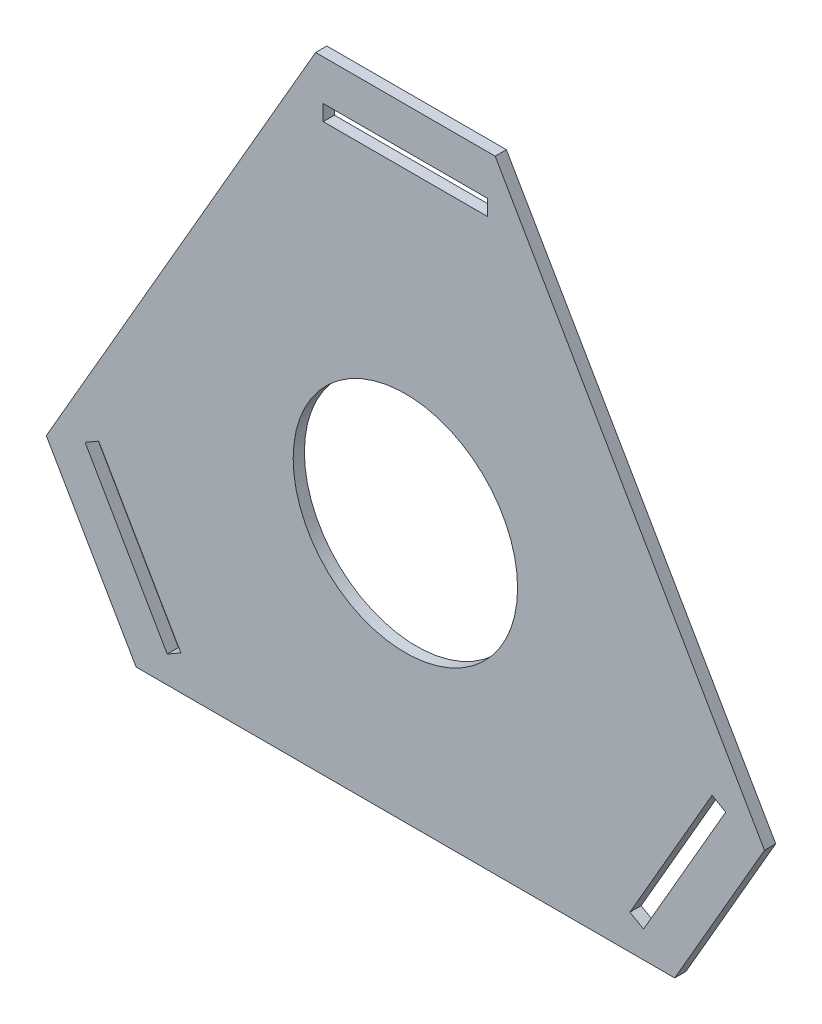
ISO-10303-21;
HEADER;
FILE_DESCRIPTION(('STEP AP214'),'2;1');
FILE_NAME('part.step','',(''),(''),'','','');
FILE_SCHEMA(('AUTOMOTIVE_DESIGN { 1 0 10303 214 1 1 1 1 }'));
ENDSEC;
DATA;
#1=APPLICATION_CONTEXT('core data for automotive mechanical design processes');
#2=APPLICATION_PROTOCOL_DEFINITION('international standard','automotive_design',2000,#1);
#3=PRODUCT_CONTEXT('',#1,'mechanical');
#4=PRODUCT('Part','Part','',(#3));
#5=PRODUCT_RELATED_PRODUCT_CATEGORY('part','',(#4));
#6=PRODUCT_DEFINITION_FORMATION('','',#4);
#7=PRODUCT_DEFINITION_CONTEXT('part definition',#1,'design');
#8=PRODUCT_DEFINITION('design','',#6,#7);
#9=PRODUCT_DEFINITION_SHAPE('','',#8);
#10=(LENGTH_UNIT() NAMED_UNIT(*) SI_UNIT(.MILLI.,.METRE.));
#11=(NAMED_UNIT(*) PLANE_ANGLE_UNIT() SI_UNIT($,.RADIAN.));
#12=(NAMED_UNIT(*) SI_UNIT($,.STERADIAN.) SOLID_ANGLE_UNIT());
#13=UNCERTAINTY_MEASURE_WITH_UNIT(LENGTH_MEASURE(1.E-05),#10,'distance_accuracy_value','');
#14=(GEOMETRIC_REPRESENTATION_CONTEXT(3) GLOBAL_UNCERTAINTY_ASSIGNED_CONTEXT((#13)) GLOBAL_UNIT_ASSIGNED_CONTEXT((#10,
#11,#12)) REPRESENTATION_CONTEXT('',''));
#15=CARTESIAN_POINT('',(0.,0.,0.));
#16=DIRECTION('',(0.,0.,1.));
#17=DIRECTION('',(1.,0.,0.));
#18=AXIS2_PLACEMENT_3D('',#15,#16,#17);
#19=CARTESIAN_POINT('',(0.,0.,5.));
#20=DIRECTION('',(0.,0.,1.));
#21=DIRECTION('',(1.,0.,0.));
#22=AXIS2_PLACEMENT_3D('',#19,#20,#21);
#23=PLANE('',#22);
#24=DIRECTION('',(0.,-1.,0.));
#25=VECTOR('',#24,1.);
#26=CARTESIAN_POINT('',(83.3923048454132,259.12812921102,5.));
#27=LINE('',#26,#25);
#28=CARTESIAN_POINT('',(83.3923048454132,259.12812921102,5.));
#29=VERTEX_POINT('',#28);
#30=CARTESIAN_POINT('',(83.3923048454132,252.12812921102,5.));
#31=VERTEX_POINT('',#30);
#32=EDGE_CURVE('E263',#29,#31,#27,.T.);
#33=ORIENTED_EDGE('',*,*,#32,.F.);
#34=DIRECTION('',(-1.,0.,0.));
#35=VECTOR('',#34,1.);
#36=CARTESIAN_POINT('',(149.607695154587,259.12812921102,5.));
#37=LINE('',#36,#35);
#38=CARTESIAN_POINT('',(156.607695154587,259.12812921102,5.));
#39=VERTEX_POINT('',#38);
#40=EDGE_CURVE('E260',#39,#29,#37,.T.);
#41=ORIENTED_EDGE('',*,*,#40,.F.);
#42=DIRECTION('',(0.,1.,0.));
#43=VECTOR('',#42,1.);
#44=CARTESIAN_POINT('',(156.607695154587,259.12812921102,5.));
#45=LINE('',#44,#43);
#46=CARTESIAN_POINT('',(156.607695154587,252.12812921102,5.));
#47=VERTEX_POINT('',#46);
#48=EDGE_CURVE('E271',#47,#39,#45,.T.);
#49=ORIENTED_EDGE('',*,*,#48,.F.);
#50=DIRECTION('',(1.,0.,0.));
#51=VECTOR('',#50,1.);
#52=CARTESIAN_POINT('',(83.3923048454132,252.12812921102,5.));
#53=LINE('',#52,#51);
#54=EDGE_CURVE('E267',#31,#47,#53,.T.);
#55=ORIENTED_EDGE('',*,*,#54,.F.);
#56=EDGE_LOOP('',(#33,#41,#49,#55));
#57=FACE_BOUND('',#56,.T.);
#58=DIRECTION('',(0.5,-0.866025403784439,0.));
#59=VECTOR('',#58,1.);
#60=CARTESIAN_POINT('',(-40.,69.2820323027551,5.));
#61=LINE('',#60,#59);
#62=CARTESIAN_POINT('',(-40.,69.2820323027551,5.));
#63=VERTEX_POINT('',#62);
#64=CARTESIAN_POINT('',(0.,0.,5.));
#65=VERTEX_POINT('',#64);
#66=EDGE_CURVE('E302',#63,#65,#61,.T.);
#67=ORIENTED_EDGE('',*,*,#66,.T.);
#68=DIRECTION('',(1.,0.,0.));
#69=VECTOR('',#68,1.);
#70=CARTESIAN_POINT('',(0.,0.,5.));
#71=LINE('',#70,#69);
#72=CARTESIAN_POINT('',(240.,0.,5.));
#73=VERTEX_POINT('',#72);
#74=EDGE_CURVE('E306',#65,#73,#71,.T.);
#75=ORIENTED_EDGE('',*,*,#74,.T.);
#76=DIRECTION('',(0.500000000000001,0.866025403784438,0.));
#77=VECTOR('',#76,1.);
#78=CARTESIAN_POINT('',(240.,0.,5.));
#79=LINE('',#78,#77);
#80=CARTESIAN_POINT('',(280.,69.282032302755,5.));
#81=VERTEX_POINT('',#80);
#82=EDGE_CURVE('E310',#73,#81,#79,.T.);
#83=ORIENTED_EDGE('',*,*,#82,.T.);
#84=DIRECTION('',(-0.5,0.866025403784439,0.));
#85=VECTOR('',#84,1.);
#86=CARTESIAN_POINT('',(280.,69.282032302755,5.));
#87=LINE('',#86,#85);
#88=CARTESIAN_POINT('',(160.,277.12812921102,5.));
#89=VERTEX_POINT('',#88);
#90=EDGE_CURVE('E313',#81,#89,#87,.T.);
#91=ORIENTED_EDGE('',*,*,#90,.T.);
#92=DIRECTION('',(-1.,0.,0.));
#93=VECTOR('',#92,1.);
#94=CARTESIAN_POINT('',(160.,277.12812921102,5.));
#95=LINE('',#94,#93);
#96=CARTESIAN_POINT('',(80.0000000000001,277.12812921102,5.));
#97=VERTEX_POINT('',#96);
#98=EDGE_CURVE('E316',#89,#97,#95,.T.);
#99=ORIENTED_EDGE('',*,*,#98,.T.);
#100=DIRECTION('',(-0.500000000000001,-0.866025403784438,0.));
#101=VECTOR('',#100,1.);
#102=CARTESIAN_POINT('',(80.0000000000001,277.12812921102,5.));
#103=LINE('',#102,#101);
#104=EDGE_CURVE('E319',#97,#63,#103,.T.);
#105=ORIENTED_EDGE('',*,*,#104,.T.);
#106=EDGE_LOOP('',(#67,#75,#83,#91,#99,#105));
#107=FACE_BOUND('',#106,.T.);
#108=CARTESIAN_POINT('',(120.,115.470053837925,5.));
#109=DIRECTION('',(0.,0.,1.));
#110=DIRECTION('',(1.,0.,0.));
#111=AXIS2_PLACEMENT_3D('',#108,#109,#110);
#112=CIRCLE('',#111,50.);
#113=CARTESIAN_POINT('',(170.,115.470053837925,5.));
#114=VERTEX_POINT('',#113);
#115=EDGE_CURVE('E252',#114,#114,#112,.T.);
#116=ORIENTED_EDGE('',*,*,#115,.F.);
#117=EDGE_LOOP('',(#116));
#118=FACE_BOUND('',#117,.T.);
#119=DIRECTION('',(-0.500000000000009,-0.866025403784434,0.));
#120=VECTOR('',#119,1.);
#121=CARTESIAN_POINT('',(256.653212482685,78.844210129247,5.));
#122=LINE('',#121,#120);
#123=CARTESIAN_POINT('',(256.653212482685,78.844210129247,5.));
#124=VERTEX_POINT('',#123);
#125=CARTESIAN_POINT('',(220.045517328098,15.4378221735098,5.));
#126=VERTEX_POINT('',#125);
#127=EDGE_CURVE('E216',#124,#126,#122,.T.);
#128=ORIENTED_EDGE('',*,*,#127,.F.);
#129=DIRECTION('',(-0.866025403784437,0.500000000000002,0.));
#130=VECTOR('',#129,1.);
#131=CARTESIAN_POINT('',(262.715390309176,75.344210129247,5.));
#132=LINE('',#131,#130);
#133=CARTESIAN_POINT('',(262.715390309176,75.344210129247,5.));
#134=VERTEX_POINT('',#133);
#135=EDGE_CURVE('E212',#134,#124,#132,.T.);
#136=ORIENTED_EDGE('',*,*,#135,.F.);
#137=DIRECTION('',(0.500000000000004,0.866025403784436,0.));
#138=VECTOR('',#137,1.);
#139=CARTESIAN_POINT('',(229.60769515459,18.0000000000007,5.));
#140=LINE('',#139,#138);
#141=CARTESIAN_POINT('',(226.10769515459,11.9378221735097,5.));
#142=VERTEX_POINT('',#141);
#143=EDGE_CURVE('E209',#142,#134,#140,.T.);
#144=ORIENTED_EDGE('',*,*,#143,.F.);
#145=DIRECTION('',(0.866025403784436,-0.500000000000005,0.));
#146=VECTOR('',#145,1.);
#147=CARTESIAN_POINT('',(226.107695154589,11.9378221735097,5.));
#148=LINE('',#147,#146);
#149=EDGE_CURVE('E219',#126,#142,#148,.T.);
#150=ORIENTED_EDGE('',*,*,#149,.F.);
#151=EDGE_LOOP('',(#128,#136,#144,#150));
#152=FACE_BOUND('',#151,.T.);
#153=DIRECTION('',(-0.499999999999985,0.866025403784447,0.));
#154=VECTOR('',#153,1.);
#155=CARTESIAN_POINT('',(19.9544826719064,15.4378221735077,5.));
#156=LINE('',#155,#154);
#157=CARTESIAN_POINT('',(19.9544826719064,15.4378221735077,5.));
#158=VERTEX_POINT('',#157);
#159=CARTESIAN_POINT('',(-16.6532124826799,78.8442101292453,5.));
#160=VERTEX_POINT('',#159);
#161=EDGE_CURVE('E180',#158,#160,#156,.T.);
#162=ORIENTED_EDGE('',*,*,#161,.F.);
#163=DIRECTION('',(0.866025403784444,0.49999999999999,0.));
#164=VECTOR('',#163,1.);
#165=CARTESIAN_POINT('',(13.8923048454154,11.9378221735078,5.));
#166=LINE('',#165,#164);
#167=CARTESIAN_POINT('',(13.8923048454154,11.9378221735078,5.));
#168=VERTEX_POINT('',#167);
#169=EDGE_CURVE('E170',#168,#158,#166,.T.);
#170=ORIENTED_EDGE('',*,*,#169,.F.);
#171=DIRECTION('',(0.499999999999992,-0.866025403784443,0.));
#172=VECTOR('',#171,1.);
#173=CARTESIAN_POINT('',(-19.2153903091712,69.2820323027542,5.));
#174=LINE('',#173,#172);
#175=CARTESIAN_POINT('',(-22.715390309171,75.3442101292453,5.));
#176=VERTEX_POINT('',#175);
#177=EDGE_CURVE('E162',#176,#168,#174,.T.);
#178=ORIENTED_EDGE('',*,*,#177,.F.);
#179=DIRECTION('',(-0.866025403784443,-0.499999999999993,0.));
#180=VECTOR('',#179,1.);
#181=CARTESIAN_POINT('',(-22.715390309171,75.3442101292453,5.));
#182=LINE('',#181,#180);
#183=EDGE_CURVE('E185',#160,#176,#182,.T.);
#184=ORIENTED_EDGE('',*,*,#183,.F.);
#185=EDGE_LOOP('',(#162,#170,#178,#184));
#186=FACE_BOUND('',#185,.T.);
#187=ADVANCED_FACE('F36',(#57,#107,#118,#152,#186),#23,.T.);
#188=CARTESIAN_POINT('',(0.,0.,0.));
#189=DIRECTION('',(0.,0.,1.));
#190=DIRECTION('',(1.,0.,0.));
#191=AXIS2_PLACEMENT_3D('',#188,#189,#190);
#192=PLANE('',#191);
#193=DIRECTION('',(-0.866025403784437,0.500000000000002,0.));
#194=VECTOR('',#193,1.);
#195=CARTESIAN_POINT('',(262.715390309176,75.344210129247,0.));
#196=LINE('',#195,#194);
#197=CARTESIAN_POINT('',(262.715390309177,75.344210129247,0.));
#198=VERTEX_POINT('',#197);
#199=CARTESIAN_POINT('',(256.653212482685,78.844210129247,0.));
#200=VERTEX_POINT('',#199);
#201=EDGE_CURVE('E176',#198,#200,#196,.T.);
#202=ORIENTED_EDGE('',*,*,#201,.T.);
#203=DIRECTION('',(-0.500000000000002,-0.866025403784437,0.));
#204=VECTOR('',#203,1.);
#205=CARTESIAN_POINT('',(220.045517328098,15.4378221735098,0.));
#206=LINE('',#205,#204);
#207=CARTESIAN_POINT('',(220.045517328098,15.4378221735098,0.));
#208=VERTEX_POINT('',#207);
#209=EDGE_CURVE('E227',#200,#208,#206,.T.);
#210=ORIENTED_EDGE('',*,*,#209,.T.);
#211=DIRECTION('',(0.866025403784436,-0.500000000000005,0.));
#212=VECTOR('',#211,1.);
#213=CARTESIAN_POINT('',(226.107695154589,11.9378221735097,0.));
#214=LINE('',#213,#212);
#215=CARTESIAN_POINT('',(226.107695154589,11.9378221735097,0.));
#216=VERTEX_POINT('',#215);
#217=EDGE_CURVE('E231',#208,#216,#214,.T.);
#218=ORIENTED_EDGE('',*,*,#217,.T.);
#219=DIRECTION('',(0.500000000000011,0.866025403784432,0.));
#220=VECTOR('',#219,1.);
#221=CARTESIAN_POINT('',(229.60769515459,18.0000000000007,0.));
#222=LINE('',#221,#220);
#223=EDGE_CURVE('E213',#216,#198,#222,.T.);
#224=ORIENTED_EDGE('',*,*,#223,.T.);
#225=EDGE_LOOP('',(#202,#210,#218,#224));
#226=FACE_BOUND('',#225,.T.);
#227=DIRECTION('',(0.5,-0.866025403784439,0.));
#228=VECTOR('',#227,1.);
#229=CARTESIAN_POINT('',(-40.,69.2820323027551,0.));
#230=LINE('',#229,#228);
#231=CARTESIAN_POINT('',(-40.,69.2820323027551,0.));
#232=VERTEX_POINT('',#231);
#233=CARTESIAN_POINT('',(0.,0.,0.));
#234=VERTEX_POINT('',#233);
#235=EDGE_CURVE('E301',#232,#234,#230,.T.);
#236=ORIENTED_EDGE('',*,*,#235,.F.);
#237=DIRECTION('',(-0.500000000000001,-0.866025403784438,0.));
#238=VECTOR('',#237,1.);
#239=CARTESIAN_POINT('',(80.0000000000001,277.12812921102,0.));
#240=LINE('',#239,#238);
#241=CARTESIAN_POINT('',(80.0000000000001,277.12812921102,0.));
#242=VERTEX_POINT('',#241);
#243=EDGE_CURVE('E307',#242,#232,#240,.T.);
#244=ORIENTED_EDGE('',*,*,#243,.F.);
#245=DIRECTION('',(-1.,0.,0.));
#246=VECTOR('',#245,1.);
#247=CARTESIAN_POINT('',(160.,277.12812921102,0.));
#248=LINE('',#247,#246);
#249=CARTESIAN_POINT('',(160.,277.12812921102,0.));
#250=VERTEX_POINT('',#249);
#251=EDGE_CURVE('E335',#250,#242,#248,.T.);
#252=ORIENTED_EDGE('',*,*,#251,.F.);
#253=DIRECTION('',(-0.5,0.866025403784439,0.));
#254=VECTOR('',#253,1.);
#255=CARTESIAN_POINT('',(280.,69.282032302755,0.));
#256=LINE('',#255,#254);
#257=CARTESIAN_POINT('',(280.,69.282032302755,0.));
#258=VERTEX_POINT('',#257);
#259=EDGE_CURVE('E332',#258,#250,#256,.T.);
#260=ORIENTED_EDGE('',*,*,#259,.F.);
#261=DIRECTION('',(0.500000000000001,0.866025403784438,0.));
#262=VECTOR('',#261,1.);
#263=CARTESIAN_POINT('',(240.,0.,0.));
#264=LINE('',#263,#262);
#265=CARTESIAN_POINT('',(240.,0.,0.));
#266=VERTEX_POINT('',#265);
#267=EDGE_CURVE('E329',#266,#258,#264,.T.);
#268=ORIENTED_EDGE('',*,*,#267,.F.);
#269=DIRECTION('',(1.,0.,0.));
#270=VECTOR('',#269,1.);
#271=CARTESIAN_POINT('',(0.,0.,0.));
#272=LINE('',#271,#270);
#273=EDGE_CURVE('E326',#234,#266,#272,.T.);
#274=ORIENTED_EDGE('',*,*,#273,.F.);
#275=EDGE_LOOP('',(#236,#244,#252,#260,#268,#274));
#276=FACE_BOUND('',#275,.T.);
#277=DIRECTION('',(-1.,0.,0.));
#278=VECTOR('',#277,1.);
#279=CARTESIAN_POINT('',(90.3923048454135,259.12812921102,0.));
#280=LINE('',#279,#278);
#281=CARTESIAN_POINT('',(156.607695154587,259.12812921102,0.));
#282=VERTEX_POINT('',#281);
#283=CARTESIAN_POINT('',(83.3923048454132,259.12812921102,0.));
#284=VERTEX_POINT('',#283);
#285=EDGE_CURVE('E256',#282,#284,#280,.T.);
#286=ORIENTED_EDGE('',*,*,#285,.T.);
#287=DIRECTION('',(0.,-1.,0.));
#288=VECTOR('',#287,1.);
#289=CARTESIAN_POINT('',(83.3923048454132,259.12812921102,0.));
#290=LINE('',#289,#288);
#291=CARTESIAN_POINT('',(83.3923048454132,252.12812921102,0.));
#292=VERTEX_POINT('',#291);
#293=EDGE_CURVE('E278',#284,#292,#290,.T.);
#294=ORIENTED_EDGE('',*,*,#293,.T.);
#295=DIRECTION('',(1.,0.,0.));
#296=VECTOR('',#295,1.);
#297=CARTESIAN_POINT('',(156.607695154587,252.12812921102,0.));
#298=LINE('',#297,#296);
#299=CARTESIAN_POINT('',(156.607695154587,252.12812921102,0.));
#300=VERTEX_POINT('',#299);
#301=EDGE_CURVE('E282',#292,#300,#298,.T.);
#302=ORIENTED_EDGE('',*,*,#301,.T.);
#303=DIRECTION('',(0.,1.,0.));
#304=VECTOR('',#303,1.);
#305=CARTESIAN_POINT('',(156.607695154587,259.12812921102,0.));
#306=LINE('',#305,#304);
#307=EDGE_CURVE('E264',#300,#282,#306,.T.);
#308=ORIENTED_EDGE('',*,*,#307,.T.);
#309=EDGE_LOOP('',(#286,#294,#302,#308));
#310=FACE_BOUND('',#309,.T.);
#311=CARTESIAN_POINT('',(120.,115.470053837925,0.));
#312=DIRECTION('',(0.,0.,1.));
#313=DIRECTION('',(1.,0.,0.));
#314=AXIS2_PLACEMENT_3D('',#311,#312,#313);
#315=CIRCLE('',#314,50.);
#316=CARTESIAN_POINT('',(170.,115.470053837925,0.));
#317=VERTEX_POINT('',#316);
#318=EDGE_CURVE('E251',#317,#317,#315,.T.);
#319=ORIENTED_EDGE('',*,*,#318,.T.);
#320=EDGE_LOOP('',(#319));
#321=FACE_BOUND('',#320,.T.);
#322=DIRECTION('',(0.866025403784444,0.49999999999999,0.));
#323=VECTOR('',#322,1.);
#324=CARTESIAN_POINT('',(13.8923048454154,11.9378221735078,0.));
#325=LINE('',#324,#323);
#326=CARTESIAN_POINT('',(13.8923048454138,11.9378221735078,0.));
#327=VERTEX_POINT('',#326);
#328=CARTESIAN_POINT('',(19.9544826719064,15.4378221735077,0.));
#329=VERTEX_POINT('',#328);
#330=EDGE_CURVE('E60',#327,#329,#325,.T.);
#331=ORIENTED_EDGE('',*,*,#330,.T.);
#332=DIRECTION('',(-0.499999999999994,0.866025403784442,0.));
#333=VECTOR('',#332,1.);
#334=CARTESIAN_POINT('',(-16.6532124826799,78.8442101292453,0.));
#335=LINE('',#334,#333);
#336=CARTESIAN_POINT('',(-16.6532124826799,78.8442101292453,0.));
#337=VERTEX_POINT('',#336);
#338=EDGE_CURVE('E192',#329,#337,#335,.T.);
#339=ORIENTED_EDGE('',*,*,#338,.T.);
#340=DIRECTION('',(-0.866025403784443,-0.499999999999993,0.));
#341=VECTOR('',#340,1.);
#342=CARTESIAN_POINT('',(-22.715390309171,75.3442101292453,0.));
#343=LINE('',#342,#341);
#344=CARTESIAN_POINT('',(-22.715390309171,75.3442101292453,0.));
#345=VERTEX_POINT('',#344);
#346=EDGE_CURVE('E196',#337,#345,#343,.T.);
#347=ORIENTED_EDGE('',*,*,#346,.T.);
#348=DIRECTION('',(0.499999999999979,-0.866025403784451,0.));
#349=VECTOR('',#348,1.);
#350=CARTESIAN_POINT('',(-19.2153903091712,69.2820323027542,0.));
#351=LINE('',#350,#349);
#352=EDGE_CURVE('E171',#345,#327,#351,.T.);
#353=ORIENTED_EDGE('',*,*,#352,.T.);
#354=EDGE_LOOP('',(#331,#339,#347,#353));
#355=FACE_BOUND('',#354,.T.);
#356=ADVANCED_FACE('F367',(#226,#276,#310,#321,#355),#192,.F.);
#357=CARTESIAN_POINT('',(-40.,69.2820323027551,5.));
#358=DIRECTION('',(0.866025403784439,0.5,0.));
#359=DIRECTION('',(-0.5,0.866025403784439,0.));
#360=AXIS2_PLACEMENT_3D('',#357,#358,#359);
#361=PLANE('',#360);
#362=ORIENTED_EDGE('',*,*,#235,.T.);
#363=DIRECTION('',(0.,0.,-1.));
#364=VECTOR('',#363,1.);
#365=CARTESIAN_POINT('',(0.,0.,5.));
#366=LINE('',#365,#364);
#367=EDGE_CURVE('E11',#65,#234,#366,.T.);
#368=ORIENTED_EDGE('',*,*,#367,.F.);
#369=ORIENTED_EDGE('',*,*,#66,.F.);
#370=DIRECTION('',(0.,0.,-1.));
#371=VECTOR('',#370,1.);
#372=CARTESIAN_POINT('',(-40.,69.2820323027551,5.));
#373=LINE('',#372,#371);
#374=EDGE_CURVE('E322',#63,#232,#373,.T.);
#375=ORIENTED_EDGE('',*,*,#374,.T.);
#376=EDGE_LOOP('',(#362,#368,#369,#375));
#377=FACE_BOUND('',#376,.T.);
#378=ADVANCED_FACE('F38',(#377),#361,.F.);
#379=CARTESIAN_POINT('',(0.,0.,5.));
#380=DIRECTION('',(0.,1.,0.));
#381=DIRECTION('',(0.,0.,1.));
#382=AXIS2_PLACEMENT_3D('',#379,#380,#381);
#383=PLANE('',#382);
#384=ORIENTED_EDGE('',*,*,#273,.T.);
#385=DIRECTION('',(0.,0.,-1.));
#386=VECTOR('',#385,1.);
#387=CARTESIAN_POINT('',(240.,0.,5.));
#388=LINE('',#387,#386);
#389=EDGE_CURVE('E45',#73,#266,#388,.T.);
#390=ORIENTED_EDGE('',*,*,#389,.F.);
#391=ORIENTED_EDGE('',*,*,#74,.F.);
#392=ORIENTED_EDGE('',*,*,#367,.T.);
#393=EDGE_LOOP('',(#384,#390,#391,#392));
#394=FACE_BOUND('',#393,.T.);
#395=ADVANCED_FACE('F385',(#394),#383,.F.);
#396=CARTESIAN_POINT('',(240.,0.,5.));
#397=DIRECTION('',(-0.866025403784438,0.500000000000001,0.));
#398=DIRECTION('',(-0.500000000000001,-0.866025403784438,0.));
#399=AXIS2_PLACEMENT_3D('',#396,#397,#398);
#400=PLANE('',#399);
#401=ORIENTED_EDGE('',*,*,#267,.T.);
#402=DIRECTION('',(0.,0.,-1.));
#403=VECTOR('',#402,1.);
#404=CARTESIAN_POINT('',(280.,69.282032302755,5.));
#405=LINE('',#404,#403);
#406=EDGE_CURVE('E351',#81,#258,#405,.T.);
#407=ORIENTED_EDGE('',*,*,#406,.F.);
#408=ORIENTED_EDGE('',*,*,#82,.F.);
#409=ORIENTED_EDGE('',*,*,#389,.T.);
#410=EDGE_LOOP('',(#401,#407,#408,#409));
#411=FACE_BOUND('',#410,.T.);
#412=ADVANCED_FACE('F361',(#411),#400,.F.);
#413=CARTESIAN_POINT('',(280.,69.282032302755,5.));
#414=DIRECTION('',(-0.866025403784439,-0.5,0.));
#415=DIRECTION('',(0.5,-0.866025403784439,0.));
#416=AXIS2_PLACEMENT_3D('',#413,#414,#415);
#417=PLANE('',#416);
#418=ORIENTED_EDGE('',*,*,#259,.T.);
#419=DIRECTION('',(0.,0.,-1.));
#420=VECTOR('',#419,1.);
#421=CARTESIAN_POINT('',(160.,277.12812921102,5.));
#422=LINE('',#421,#420);
#423=EDGE_CURVE('E347',#89,#250,#422,.T.);
#424=ORIENTED_EDGE('',*,*,#423,.F.);
#425=ORIENTED_EDGE('',*,*,#90,.F.);
#426=ORIENTED_EDGE('',*,*,#406,.T.);
#427=EDGE_LOOP('',(#418,#424,#425,#426));
#428=FACE_BOUND('',#427,.T.);
#429=ADVANCED_FACE('F373',(#428),#417,.F.);
#430=CARTESIAN_POINT('',(160.,277.12812921102,5.));
#431=DIRECTION('',(0.,-1.,0.));
#432=DIRECTION('',(1.,0.,0.));
#433=AXIS2_PLACEMENT_3D('',#430,#431,#432);
#434=PLANE('',#433);
#435=ORIENTED_EDGE('',*,*,#251,.T.);
#436=DIRECTION('',(0.,0.,-1.));
#437=VECTOR('',#436,1.);
#438=CARTESIAN_POINT('',(80.0000000000001,277.12812921102,5.));
#439=LINE('',#438,#437);
#440=EDGE_CURVE('E343',#97,#242,#439,.T.);
#441=ORIENTED_EDGE('',*,*,#440,.F.);
#442=ORIENTED_EDGE('',*,*,#98,.F.);
#443=ORIENTED_EDGE('',*,*,#423,.T.);
#444=EDGE_LOOP('',(#435,#441,#442,#443));
#445=FACE_BOUND('',#444,.T.);
#446=ADVANCED_FACE('F377',(#445),#434,.F.);
#447=CARTESIAN_POINT('',(80.0000000000001,277.12812921102,5.));
#448=DIRECTION('',(0.866025403784438,-0.500000000000001,0.));
#449=DIRECTION('',(0.500000000000001,0.866025403784438,0.));
#450=AXIS2_PLACEMENT_3D('',#447,#448,#449);
#451=PLANE('',#450);
#452=ORIENTED_EDGE('',*,*,#243,.T.);
#453=ORIENTED_EDGE('',*,*,#374,.F.);
#454=ORIENTED_EDGE('',*,*,#104,.F.);
#455=ORIENTED_EDGE('',*,*,#440,.T.);
#456=EDGE_LOOP('',(#452,#453,#454,#455));
#457=FACE_BOUND('',#456,.T.);
#458=ADVANCED_FACE('F388',(#457),#451,.F.);
#459=CARTESIAN_POINT('',(90.3923048454135,259.12812921102,5.));
#460=DIRECTION('',(0.,-1.,0.));
#461=DIRECTION('',(1.,0.,0.));
#462=AXIS2_PLACEMENT_3D('',#459,#460,#461);
#463=PLANE('',#462);
#464=ORIENTED_EDGE('',*,*,#285,.F.);
#465=DIRECTION('',(0.,0.,-1.));
#466=VECTOR('',#465,1.);
#467=CARTESIAN_POINT('',(156.607695154587,259.12812921102,5.));
#468=LINE('',#467,#466);
#469=EDGE_CURVE('E274',#39,#282,#468,.T.);
#470=ORIENTED_EDGE('',*,*,#469,.F.);
#471=ORIENTED_EDGE('',*,*,#40,.T.);
#472=DIRECTION('',(0.,0.,-1.));
#473=VECTOR('',#472,1.);
#474=CARTESIAN_POINT('',(83.3923048454132,259.12812921102,5.));
#475=LINE('',#474,#473);
#476=EDGE_CURVE('E298',#29,#284,#475,.T.);
#477=ORIENTED_EDGE('',*,*,#476,.T.);
#478=EDGE_LOOP('',(#464,#470,#471,#477));
#479=FACE_BOUND('',#478,.T.);
#480=ADVANCED_FACE('F390',(#479),#463,.T.);
#481=CARTESIAN_POINT('',(83.3923048454132,259.12812921102,5.));
#482=DIRECTION('',(1.,0.,0.));
#483=DIRECTION('',(0.,0.,-1.));
#484=AXIS2_PLACEMENT_3D('',#481,#482,#483);
#485=PLANE('',#484);
#486=ORIENTED_EDGE('',*,*,#293,.F.);
#487=ORIENTED_EDGE('',*,*,#476,.F.);
#488=ORIENTED_EDGE('',*,*,#32,.T.);
#489=DIRECTION('',(0.,0.,-1.));
#490=VECTOR('',#489,1.);
#491=CARTESIAN_POINT('',(83.3923048454132,252.12812921102,5.));
#492=LINE('',#491,#490);
#493=EDGE_CURVE('E294',#31,#292,#492,.T.);
#494=ORIENTED_EDGE('',*,*,#493,.T.);
#495=EDGE_LOOP('',(#486,#487,#488,#494));
#496=FACE_BOUND('',#495,.T.);
#497=ADVANCED_FACE('F397',(#496),#485,.T.);
#498=CARTESIAN_POINT('',(156.607695154587,252.12812921102,5.));
#499=DIRECTION('',(0.,1.,0.));
#500=DIRECTION('',(-1.,0.,0.));
#501=AXIS2_PLACEMENT_3D('',#498,#499,#500);
#502=PLANE('',#501);
#503=ORIENTED_EDGE('',*,*,#301,.F.);
#504=ORIENTED_EDGE('',*,*,#493,.F.);
#505=ORIENTED_EDGE('',*,*,#54,.T.);
#506=DIRECTION('',(0.,0.,-1.));
#507=VECTOR('',#506,1.);
#508=CARTESIAN_POINT('',(156.607695154587,252.12812921102,5.));
#509=LINE('',#508,#507);
#510=EDGE_CURVE('E291',#47,#300,#509,.T.);
#511=ORIENTED_EDGE('',*,*,#510,.T.);
#512=EDGE_LOOP('',(#503,#504,#505,#511));
#513=FACE_BOUND('',#512,.T.);
#514=ADVANCED_FACE('F412',(#513),#502,.T.);
#515=CARTESIAN_POINT('',(156.607695154587,259.12812921102,5.));
#516=DIRECTION('',(-1.,0.,0.));
#517=DIRECTION('',(0.,0.,1.));
#518=AXIS2_PLACEMENT_3D('',#515,#516,#517);
#519=PLANE('',#518);
#520=ORIENTED_EDGE('',*,*,#307,.F.);
#521=ORIENTED_EDGE('',*,*,#510,.F.);
#522=ORIENTED_EDGE('',*,*,#48,.T.);
#523=ORIENTED_EDGE('',*,*,#469,.T.);
#524=EDGE_LOOP('',(#520,#521,#522,#523));
#525=FACE_BOUND('',#524,.T.);
#526=ADVANCED_FACE('F416',(#525),#519,.T.);
#527=CARTESIAN_POINT('',(120.,115.470053837925,5.));
#528=DIRECTION('',(0.,0.,-1.));
#529=DIRECTION('',(-1.,0.,0.));
#530=AXIS2_PLACEMENT_3D('',#527,#528,#529);
#531=CYLINDRICAL_SURFACE('',#530,50.);
#532=ORIENTED_EDGE('',*,*,#115,.T.);
#533=EDGE_LOOP('',(#532));
#534=FACE_BOUND('',#533,.T.);
#535=ORIENTED_EDGE('',*,*,#318,.F.);
#536=EDGE_LOOP('',(#535));
#537=FACE_BOUND('',#536,.T.);
#538=ADVANCED_FACE('F420',(#534,#537),#531,.F.);
#539=CARTESIAN_POINT('',(262.715390309176,75.344210129247,5.));
#540=DIRECTION('',(-0.500000000000002,-0.866025403784437,0.));
#541=DIRECTION('',(0.866025403784437,-0.500000000000002,0.));
#542=AXIS2_PLACEMENT_3D('',#539,#540,#541);
#543=PLANE('',#542);
#544=ORIENTED_EDGE('',*,*,#201,.F.);
#545=DIRECTION('',(0.,0.,-1.));
#546=VECTOR('',#545,1.);
#547=CARTESIAN_POINT('',(262.715390309176,75.344210129247,5.));
#548=LINE('',#547,#546);
#549=EDGE_CURVE('E247',#134,#198,#548,.T.);
#550=ORIENTED_EDGE('',*,*,#549,.F.);
#551=ORIENTED_EDGE('',*,*,#135,.T.);
#552=DIRECTION('',(0.,0.,-1.));
#553=VECTOR('',#552,1.);
#554=CARTESIAN_POINT('',(256.653212482685,78.844210129247,5.));
#555=LINE('',#554,#553);
#556=EDGE_CURVE('E243',#124,#200,#555,.T.);
#557=ORIENTED_EDGE('',*,*,#556,.T.);
#558=EDGE_LOOP('',(#544,#550,#551,#557));
#559=FACE_BOUND('',#558,.T.);
#560=ADVANCED_FACE('F424',(#559),#543,.T.);
#561=CARTESIAN_POINT('',(220.045517328098,15.4378221735098,5.));
#562=DIRECTION('',(0.866025403784437,-0.500000000000002,0.));
#563=DIRECTION('',(0.500000000000002,0.866025403784437,0.));
#564=AXIS2_PLACEMENT_3D('',#561,#562,#563);
#565=PLANE('',#564);
#566=ORIENTED_EDGE('',*,*,#209,.F.);
#567=ORIENTED_EDGE('',*,*,#556,.F.);
#568=ORIENTED_EDGE('',*,*,#127,.T.);
#569=DIRECTION('',(0.,0.,-1.));
#570=VECTOR('',#569,1.);
#571=CARTESIAN_POINT('',(220.045517328098,15.4378221735098,5.));
#572=LINE('',#571,#570);
#573=EDGE_CURVE('E240',#126,#208,#572,.T.);
#574=ORIENTED_EDGE('',*,*,#573,.T.);
#575=EDGE_LOOP('',(#566,#567,#568,#574));
#576=FACE_BOUND('',#575,.T.);
#577=ADVANCED_FACE('F428',(#576),#565,.T.);
#578=CARTESIAN_POINT('',(226.107695154589,11.9378221735097,5.));
#579=DIRECTION('',(0.500000000000004,0.866025403784436,0.));
#580=DIRECTION('',(-0.866025403784436,0.500000000000004,0.));
#581=AXIS2_PLACEMENT_3D('',#578,#579,#580);
#582=PLANE('',#581);
#583=ORIENTED_EDGE('',*,*,#217,.F.);
#584=ORIENTED_EDGE('',*,*,#573,.F.);
#585=ORIENTED_EDGE('',*,*,#149,.T.);
#586=DIRECTION('',(0.,0.,-1.));
#587=VECTOR('',#586,1.);
#588=CARTESIAN_POINT('',(226.107695154589,11.9378221735097,5.));
#589=LINE('',#588,#587);
#590=EDGE_CURVE('E223',#142,#216,#589,.T.);
#591=ORIENTED_EDGE('',*,*,#590,.T.);
#592=EDGE_LOOP('',(#583,#584,#585,#591));
#593=FACE_BOUND('',#592,.T.);
#594=ADVANCED_FACE('F432',(#593),#582,.T.);
#595=CARTESIAN_POINT('',(229.60769515459,18.0000000000007,5.));
#596=DIRECTION('',(-0.866025403784432,0.500000000000011,0.));
#597=DIRECTION('',(-0.500000000000011,-0.866025403784432,0.));
#598=AXIS2_PLACEMENT_3D('',#595,#596,#597);
#599=PLANE('',#598);
#600=ORIENTED_EDGE('',*,*,#223,.F.);
#601=ORIENTED_EDGE('',*,*,#590,.F.);
#602=ORIENTED_EDGE('',*,*,#143,.T.);
#603=ORIENTED_EDGE('',*,*,#549,.T.);
#604=EDGE_LOOP('',(#600,#601,#602,#603));
#605=FACE_BOUND('',#604,.T.);
#606=ADVANCED_FACE('F436',(#605),#599,.T.);
#607=CARTESIAN_POINT('',(13.8923048454154,11.9378221735078,5.));
#608=DIRECTION('',(-0.49999999999999,0.866025403784444,0.));
#609=DIRECTION('',(-0.866025403784445,-0.49999999999999,0.));
#610=AXIS2_PLACEMENT_3D('',#607,#608,#609);
#611=PLANE('',#610);
#612=ORIENTED_EDGE('',*,*,#330,.F.);
#613=DIRECTION('',(0.,0.,-1.));
#614=VECTOR('',#613,1.);
#615=CARTESIAN_POINT('',(13.8923048454154,11.9378221735078,5.));
#616=LINE('',#615,#614);
#617=EDGE_CURVE('E164',#168,#327,#616,.T.);
#618=ORIENTED_EDGE('',*,*,#617,.F.);
#619=ORIENTED_EDGE('',*,*,#169,.T.);
#620=DIRECTION('',(0.,0.,-1.));
#621=VECTOR('',#620,1.);
#622=CARTESIAN_POINT('',(19.9544826719064,15.4378221735077,5.));
#623=LINE('',#622,#621);
#624=EDGE_CURVE('E177',#158,#329,#623,.T.);
#625=ORIENTED_EDGE('',*,*,#624,.T.);
#626=EDGE_LOOP('',(#612,#618,#619,#625));
#627=FACE_BOUND('',#626,.T.);
#628=ADVANCED_FACE('F173',(#627),#611,.T.);
#629=CARTESIAN_POINT('',(-16.6532124826799,78.8442101292453,5.));
#630=DIRECTION('',(-0.866025403784442,-0.499999999999994,0.));
#631=DIRECTION('',(0.499999999999994,-0.866025403784442,0.));
#632=AXIS2_PLACEMENT_3D('',#629,#630,#631);
#633=PLANE('',#632);
#634=ORIENTED_EDGE('',*,*,#338,.F.);
#635=ORIENTED_EDGE('',*,*,#624,.F.);
#636=ORIENTED_EDGE('',*,*,#161,.T.);
#637=DIRECTION('',(0.,0.,-1.));
#638=VECTOR('',#637,1.);
#639=CARTESIAN_POINT('',(-16.6532124826799,78.8442101292453,5.));
#640=LINE('',#639,#638);
#641=EDGE_CURVE('E204',#160,#337,#640,.T.);
#642=ORIENTED_EDGE('',*,*,#641,.T.);
#643=EDGE_LOOP('',(#634,#635,#636,#642));
#644=FACE_BOUND('',#643,.T.);
#645=ADVANCED_FACE('F443',(#644),#633,.T.);
#646=CARTESIAN_POINT('',(-22.715390309171,75.3442101292453,5.));
#647=DIRECTION('',(0.499999999999993,-0.866025403784443,0.));
#648=DIRECTION('',(0.866025403784443,0.499999999999993,0.));
#649=AXIS2_PLACEMENT_3D('',#646,#647,#648);
#650=PLANE('',#649);
#651=ORIENTED_EDGE('',*,*,#346,.F.);
#652=ORIENTED_EDGE('',*,*,#641,.F.);
#653=ORIENTED_EDGE('',*,*,#183,.T.);
#654=DIRECTION('',(0.,0.,-1.));
#655=VECTOR('',#654,1.);
#656=CARTESIAN_POINT('',(-22.715390309171,75.3442101292453,5.));
#657=LINE('',#656,#655);
#658=EDGE_CURVE('E52',#176,#345,#657,.T.);
#659=ORIENTED_EDGE('',*,*,#658,.T.);
#660=EDGE_LOOP('',(#651,#652,#653,#659));
#661=FACE_BOUND('',#660,.T.);
#662=ADVANCED_FACE('F446',(#661),#650,.T.);
#663=CARTESIAN_POINT('',(-19.2153903091712,69.2820323027542,5.));
#664=DIRECTION('',(0.866025403784451,0.499999999999979,0.));
#665=DIRECTION('',(-0.499999999999979,0.866025403784451,0.));
#666=AXIS2_PLACEMENT_3D('',#663,#664,#665);
#667=PLANE('',#666);
#668=ORIENTED_EDGE('',*,*,#352,.F.);
#669=ORIENTED_EDGE('',*,*,#658,.F.);
#670=ORIENTED_EDGE('',*,*,#177,.T.);
#671=ORIENTED_EDGE('',*,*,#617,.T.);
#672=EDGE_LOOP('',(#668,#669,#670,#671));
#673=FACE_BOUND('',#672,.T.);
#674=ADVANCED_FACE('F163',(#673),#667,.T.);
#675=CLOSED_SHELL('',(#187,#356,#378,#395,#412,#429,#446,#458,#480,#497,#514,#526,#538,#560,
#577,#594,#606,#628,#645,#662,#674));
#676=MANIFOLD_SOLID_BREP('B2',#675);
#677=ADVANCED_BREP_SHAPE_REPRESENTATION('',(#18,#676),#14);
#678=SHAPE_DEFINITION_REPRESENTATION(#9,#677);
ENDSEC;
END-ISO-10303-21;
